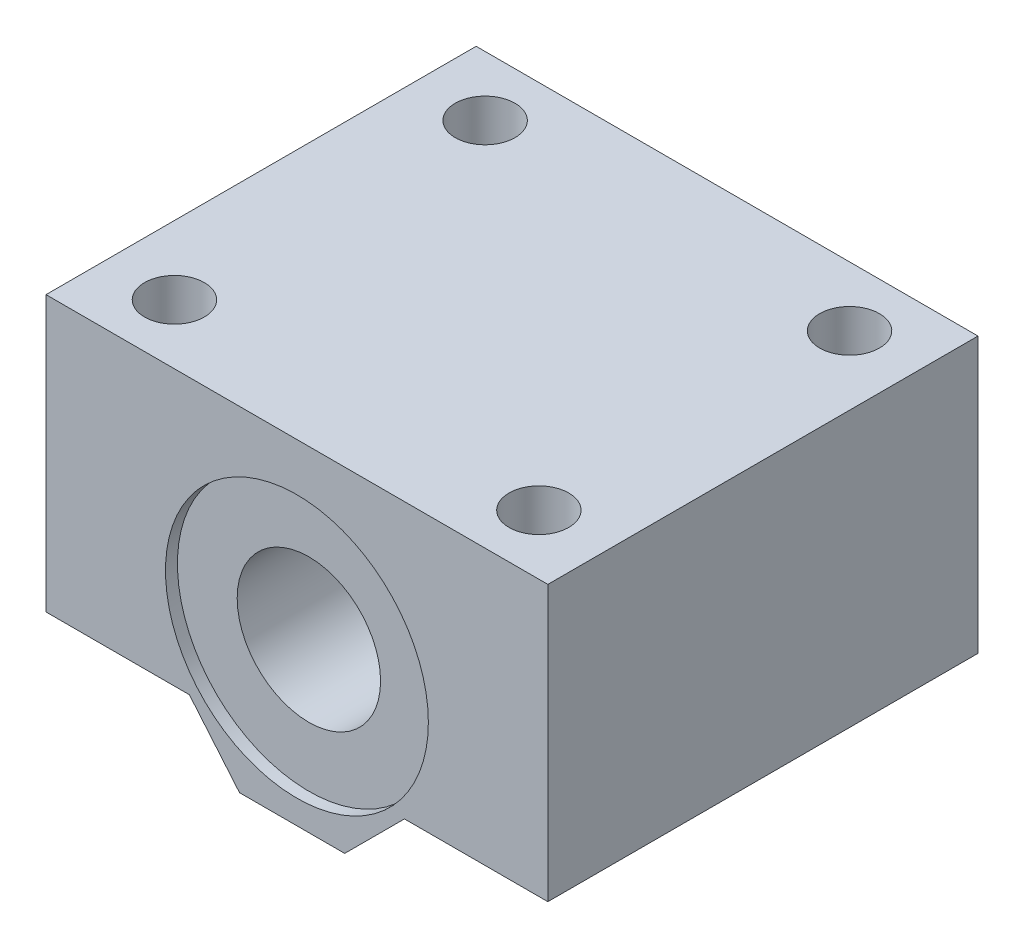
ISO-10303-21;
HEADER;
FILE_DESCRIPTION(('STEP AP214'),'2;1');
FILE_NAME('part.step','',(''),(''),'','','');
FILE_SCHEMA(('AUTOMOTIVE_DESIGN { 1 0 10303 214 1 1 1 1 }'));
ENDSEC;
DATA;
#1=APPLICATION_CONTEXT('core data for automotive mechanical design processes');
#2=APPLICATION_PROTOCOL_DEFINITION('international standard','automotive_design',2000,#1);
#3=PRODUCT_CONTEXT('',#1,'mechanical');
#4=PRODUCT('Part','Part','',(#3));
#5=PRODUCT_RELATED_PRODUCT_CATEGORY('part','',(#4));
#6=PRODUCT_DEFINITION_FORMATION('','',#4);
#7=PRODUCT_DEFINITION_CONTEXT('part definition',#1,'design');
#8=PRODUCT_DEFINITION('design','',#6,#7);
#9=PRODUCT_DEFINITION_SHAPE('','',#8);
#10=(LENGTH_UNIT() NAMED_UNIT(*) SI_UNIT(.MILLI.,.METRE.));
#11=(NAMED_UNIT(*) PLANE_ANGLE_UNIT() SI_UNIT($,.RADIAN.));
#12=(NAMED_UNIT(*) SI_UNIT($,.STERADIAN.) SOLID_ANGLE_UNIT());
#13=UNCERTAINTY_MEASURE_WITH_UNIT(LENGTH_MEASURE(1.E-05),#10,'distance_accuracy_value','');
#14=(GEOMETRIC_REPRESENTATION_CONTEXT(3) GLOBAL_UNCERTAINTY_ASSIGNED_CONTEXT((#13)) GLOBAL_UNIT_ASSIGNED_CONTEXT((#10,
#11,#12)) REPRESENTATION_CONTEXT('',''));
#15=CARTESIAN_POINT('',(0.,0.,0.));
#16=DIRECTION('',(0.,0.,1.));
#17=DIRECTION('',(1.,0.,0.));
#18=AXIS2_PLACEMENT_3D('',#15,#16,#17);
#19=CARTESIAN_POINT('',(0.,-1.,18.));
#20=DIRECTION('',(0.,0.,-1.));
#21=DIRECTION('',(-1.,0.,0.));
#22=AXIS2_PLACEMENT_3D('',#19,#20,#21);
#23=CYLINDRICAL_SURFACE('',#22,6.);
#24=CARTESIAN_POINT('',(0.,-1.,17.));
#25=DIRECTION('',(0.,0.,1.));
#26=DIRECTION('',(1.,0.,0.));
#27=AXIS2_PLACEMENT_3D('',#24,#25,#26);
#28=CIRCLE('',#27,6.);
#29=CARTESIAN_POINT('',(6.00000000000001,-1.,17.));
#30=VERTEX_POINT('',#29);
#31=EDGE_CURVE('E173',#30,#30,#28,.T.);
#32=ORIENTED_EDGE('',*,*,#31,.T.);
#33=EDGE_LOOP('',(#32));
#34=FACE_BOUND('',#33,.T.);
#35=CARTESIAN_POINT('',(0.,-1.,-17.));
#36=DIRECTION('',(0.,0.,-1.));
#37=DIRECTION('',(-1.,0.,0.));
#38=AXIS2_PLACEMENT_3D('',#35,#36,#37);
#39=CIRCLE('',#38,6.);
#40=CARTESIAN_POINT('',(-6.,-1.,-17.));
#41=VERTEX_POINT('',#40);
#42=EDGE_CURVE('E38',#41,#41,#39,.T.);
#43=ORIENTED_EDGE('',*,*,#42,.T.);
#44=EDGE_LOOP('',(#43));
#45=FACE_BOUND('',#44,.T.);
#46=ADVANCED_FACE('F34',(#34,#45),#23,.F.);
#47=CARTESIAN_POINT('',(-21.,14.,18.));
#48=DIRECTION('',(0.,-1.,0.));
#49=DIRECTION('',(0.,0.,-1.));
#50=AXIS2_PLACEMENT_3D('',#47,#48,#49);
#51=PLANE('',#50);
#52=CARTESIAN_POINT('',(15.25,14.,-13.));
#53=DIRECTION('',(0.,-1.,0.));
#54=DIRECTION('',(0.,0.,-1.));
#55=AXIS2_PLACEMENT_3D('',#52,#53,#54);
#56=CIRCLE('',#55,2.5);
#57=CARTESIAN_POINT('',(15.25,14.,-15.5));
#58=VERTEX_POINT('',#57);
#59=EDGE_CURVE('E171',#58,#58,#56,.T.);
#60=ORIENTED_EDGE('',*,*,#59,.T.);
#61=EDGE_LOOP('',(#60));
#62=FACE_BOUND('',#61,.T.);
#63=CARTESIAN_POINT('',(-15.25,14.,13.));
#64=DIRECTION('',(0.,-1.,0.));
#65=DIRECTION('',(0.,0.,-1.));
#66=AXIS2_PLACEMENT_3D('',#63,#64,#65);
#67=CIRCLE('',#66,2.5);
#68=CARTESIAN_POINT('',(-15.25,14.,10.5));
#69=VERTEX_POINT('',#68);
#70=EDGE_CURVE('E162',#69,#69,#67,.T.);
#71=ORIENTED_EDGE('',*,*,#70,.T.);
#72=EDGE_LOOP('',(#71));
#73=FACE_BOUND('',#72,.T.);
#74=DIRECTION('',(-1.,0.,0.));
#75=VECTOR('',#74,1.);
#76=CARTESIAN_POINT('',(-21.,14.,-18.));
#77=LINE('',#76,#75);
#78=CARTESIAN_POINT('',(21.,14.,-18.));
#79=VERTEX_POINT('',#78);
#80=CARTESIAN_POINT('',(-21.,14.,-18.));
#81=VERTEX_POINT('',#80);
#82=EDGE_CURVE('E123',#79,#81,#77,.T.);
#83=ORIENTED_EDGE('',*,*,#82,.T.);
#84=DIRECTION('',(0.,0.,-1.));
#85=VECTOR('',#84,1.);
#86=CARTESIAN_POINT('',(-21.,14.,18.));
#87=LINE('',#86,#85);
#88=CARTESIAN_POINT('',(-21.,14.,18.));
#89=VERTEX_POINT('',#88);
#90=EDGE_CURVE('E43',#89,#81,#87,.T.);
#91=ORIENTED_EDGE('',*,*,#90,.F.);
#92=DIRECTION('',(-1.,0.,0.));
#93=VECTOR('',#92,1.);
#94=CARTESIAN_POINT('',(-21.,14.,18.));
#95=LINE('',#94,#93);
#96=CARTESIAN_POINT('',(21.,14.,18.));
#97=VERTEX_POINT('',#96);
#98=EDGE_CURVE('E225',#97,#89,#95,.T.);
#99=ORIENTED_EDGE('',*,*,#98,.F.);
#100=DIRECTION('',(0.,0.,-1.));
#101=VECTOR('',#100,1.);
#102=CARTESIAN_POINT('',(21.,14.,18.));
#103=LINE('',#102,#101);
#104=EDGE_CURVE('E11',#97,#79,#103,.T.);
#105=ORIENTED_EDGE('',*,*,#104,.T.);
#106=EDGE_LOOP('',(#83,#91,#99,#105));
#107=FACE_BOUND('',#106,.T.);
#108=CARTESIAN_POINT('',(15.25,14.,13.));
#109=DIRECTION('',(0.,-1.,0.));
#110=DIRECTION('',(0.,0.,-1.));
#111=AXIS2_PLACEMENT_3D('',#108,#109,#110);
#112=CIRCLE('',#111,2.5);
#113=CARTESIAN_POINT('',(15.25,14.,10.5));
#114=VERTEX_POINT('',#113);
#115=EDGE_CURVE('E167',#114,#114,#112,.T.);
#116=ORIENTED_EDGE('',*,*,#115,.T.);
#117=EDGE_LOOP('',(#116));
#118=FACE_BOUND('',#117,.T.);
#119=CARTESIAN_POINT('',(-15.25,14.,-13.));
#120=DIRECTION('',(0.,-1.,0.));
#121=DIRECTION('',(0.,0.,-1.));
#122=AXIS2_PLACEMENT_3D('',#119,#120,#121);
#123=CIRCLE('',#122,2.5);
#124=CARTESIAN_POINT('',(-15.25,14.,-15.5));
#125=VERTEX_POINT('',#124);
#126=EDGE_CURVE('E175',#125,#125,#123,.T.);
#127=ORIENTED_EDGE('',*,*,#126,.T.);
#128=EDGE_LOOP('',(#127));
#129=FACE_BOUND('',#128,.T.);
#130=ADVANCED_FACE('F246',(#62,#73,#107,#118,#129),#51,.F.);
#131=CARTESIAN_POINT('',(-21.,-9.00000000000001,-18.));
#132=DIRECTION('',(0.,1.,0.));
#133=DIRECTION('',(0.,0.,1.));
#134=AXIS2_PLACEMENT_3D('',#131,#132,#133);
#135=PLANE('',#134);
#136=CARTESIAN_POINT('',(-15.25,-9.00000000000001,13.));
#137=DIRECTION('',(0.,1.,0.));
#138=DIRECTION('',(0.,0.,1.));
#139=AXIS2_PLACEMENT_3D('',#136,#137,#138);
#140=CIRCLE('',#139,2.15);
#141=CARTESIAN_POINT('',(-15.25,-9.00000000000001,15.15));
#142=VERTEX_POINT('',#141);
#143=EDGE_CURVE('E142',#142,#142,#140,.F.);
#144=ORIENTED_EDGE('',*,*,#143,.F.);
#145=EDGE_LOOP('',(#144));
#146=FACE_BOUND('',#145,.T.);
#147=DIRECTION('',(-1.,0.,0.));
#148=VECTOR('',#147,1.);
#149=CARTESIAN_POINT('',(-21.,-9.00000000000001,18.));
#150=LINE('',#149,#148);
#151=CARTESIAN_POINT('',(-9.,-9.00000000000001,18.));
#152=VERTEX_POINT('',#151);
#153=CARTESIAN_POINT('',(-21.,-9.00000000000001,18.));
#154=VERTEX_POINT('',#153);
#155=EDGE_CURVE('E215',#152,#154,#150,.T.);
#156=ORIENTED_EDGE('',*,*,#155,.T.);
#157=DIRECTION('',(0.,0.,1.));
#158=VECTOR('',#157,1.);
#159=CARTESIAN_POINT('',(-21.,-9.00000000000001,-18.));
#160=LINE('',#159,#158);
#161=CARTESIAN_POINT('',(-21.,-9.00000000000001,-18.));
#162=VERTEX_POINT('',#161);
#163=EDGE_CURVE('E124',#162,#154,#160,.T.);
#164=ORIENTED_EDGE('',*,*,#163,.F.);
#165=DIRECTION('',(-1.,0.,0.));
#166=VECTOR('',#165,1.);
#167=CARTESIAN_POINT('',(-21.,-9.00000000000001,-18.));
#168=LINE('',#167,#166);
#169=CARTESIAN_POINT('',(-9.,-9.00000000000001,-18.));
#170=VERTEX_POINT('',#169);
#171=EDGE_CURVE('E214',#170,#162,#168,.T.);
#172=ORIENTED_EDGE('',*,*,#171,.F.);
#173=DIRECTION('',(0.,0.,1.));
#174=VECTOR('',#173,1.);
#175=CARTESIAN_POINT('',(-9.,-9.00000000000001,-18.));
#176=LINE('',#175,#174);
#177=EDGE_CURVE('E129',#170,#152,#176,.T.);
#178=ORIENTED_EDGE('',*,*,#177,.T.);
#179=EDGE_LOOP('',(#156,#164,#172,#178));
#180=FACE_BOUND('',#179,.T.);
#181=CARTESIAN_POINT('',(-15.25,-9.00000000000001,-13.));
#182=DIRECTION('',(0.,1.,0.));
#183=DIRECTION('',(0.,0.,1.));
#184=AXIS2_PLACEMENT_3D('',#181,#182,#183);
#185=CIRCLE('',#184,2.15);
#186=CARTESIAN_POINT('',(-15.25,-9.00000000000001,-10.85));
#187=VERTEX_POINT('',#186);
#188=EDGE_CURVE('E152',#187,#187,#185,.F.);
#189=ORIENTED_EDGE('',*,*,#188,.F.);
#190=EDGE_LOOP('',(#189));
#191=FACE_BOUND('',#190,.T.);
#192=ADVANCED_FACE('F249',(#146,#180,#191),#135,.F.);
#193=CARTESIAN_POINT('',(21.,-9.00000000000001,-18.));
#194=DIRECTION('',(0.,1.,0.));
#195=DIRECTION('',(-1.,0.,0.));
#196=AXIS2_PLACEMENT_3D('',#193,#194,#195);
#197=PLANE('',#196);
#198=CARTESIAN_POINT('',(15.25,-9.00000000000001,13.));
#199=DIRECTION('',(0.,1.,0.));
#200=DIRECTION('',(-1.,0.,0.));
#201=AXIS2_PLACEMENT_3D('',#198,#199,#200);
#202=CIRCLE('',#201,2.15);
#203=CARTESIAN_POINT('',(13.1,-9.00000000000001,13.));
#204=VERTEX_POINT('',#203);
#205=EDGE_CURVE('E146',#204,#204,#202,.F.);
#206=ORIENTED_EDGE('',*,*,#205,.F.);
#207=EDGE_LOOP('',(#206));
#208=FACE_BOUND('',#207,.T.);
#209=DIRECTION('',(-1.,0.,0.));
#210=VECTOR('',#209,1.);
#211=CARTESIAN_POINT('',(21.,-9.00000000000001,18.));
#212=LINE('',#211,#210);
#213=CARTESIAN_POINT('',(21.,-9.00000000000001,18.));
#214=VERTEX_POINT('',#213);
#215=CARTESIAN_POINT('',(9.00000000000001,-9.00000000000001,18.));
#216=VERTEX_POINT('',#215);
#217=EDGE_CURVE('E145',#214,#216,#212,.T.);
#218=ORIENTED_EDGE('',*,*,#217,.T.);
#219=DIRECTION('',(0.,0.,1.));
#220=VECTOR('',#219,1.);
#221=CARTESIAN_POINT('',(9.00000000000001,-9.00000000000001,-18.));
#222=LINE('',#221,#220);
#223=CARTESIAN_POINT('',(9.00000000000001,-9.00000000000001,-18.));
#224=VERTEX_POINT('',#223);
#225=EDGE_CURVE('E107',#224,#216,#222,.T.);
#226=ORIENTED_EDGE('',*,*,#225,.F.);
#227=DIRECTION('',(-1.,0.,0.));
#228=VECTOR('',#227,1.);
#229=CARTESIAN_POINT('',(21.,-9.00000000000001,-18.));
#230=LINE('',#229,#228);
#231=CARTESIAN_POINT('',(21.,-9.00000000000001,-18.));
#232=VERTEX_POINT('',#231);
#233=EDGE_CURVE('E100',#232,#224,#230,.T.);
#234=ORIENTED_EDGE('',*,*,#233,.F.);
#235=DIRECTION('',(0.,0.,1.));
#236=VECTOR('',#235,1.);
#237=CARTESIAN_POINT('',(21.,-9.00000000000001,-18.));
#238=LINE('',#237,#236);
#239=EDGE_CURVE('E105',#232,#214,#238,.T.);
#240=ORIENTED_EDGE('',*,*,#239,.T.);
#241=EDGE_LOOP('',(#218,#226,#234,#240));
#242=FACE_BOUND('',#241,.T.);
#243=CARTESIAN_POINT('',(15.25,-9.00000000000001,-13.));
#244=DIRECTION('',(0.,1.,0.));
#245=DIRECTION('',(-1.,0.,0.));
#246=AXIS2_PLACEMENT_3D('',#243,#244,#245);
#247=CIRCLE('',#246,2.15);
#248=CARTESIAN_POINT('',(13.1,-9.00000000000001,-13.));
#249=VERTEX_POINT('',#248);
#250=EDGE_CURVE('E149',#249,#249,#247,.F.);
#251=ORIENTED_EDGE('',*,*,#250,.F.);
#252=EDGE_LOOP('',(#251));
#253=FACE_BOUND('',#252,.T.);
#254=ADVANCED_FACE('F103',(#208,#242,#253),#197,.F.);
#255=CARTESIAN_POINT('',(0.,0.,18.));
#256=DIRECTION('',(0.,0.,-1.));
#257=DIRECTION('',(-1.,0.,0.));
#258=AXIS2_PLACEMENT_3D('',#255,#256,#257);
#259=PLANE('',#258);
#260=CARTESIAN_POINT('',(0.,-1.,18.));
#261=DIRECTION('',(0.,0.,1.));
#262=DIRECTION('',(1.,0.,0.));
#263=AXIS2_PLACEMENT_3D('',#260,#261,#262);
#264=CIRCLE('',#263,11.);
#265=CARTESIAN_POINT('',(11.,-1.,18.));
#266=VERTEX_POINT('',#265);
#267=EDGE_CURVE('E182',#266,#266,#264,.T.);
#268=ORIENTED_EDGE('',*,*,#267,.F.);
#269=EDGE_LOOP('',(#268));
#270=FACE_BOUND('',#269,.T.);
#271=DIRECTION('',(1.,0.,0.));
#272=VECTOR('',#271,1.);
#273=CARTESIAN_POINT('',(-21.,-14.,18.));
#274=LINE('',#273,#272);
#275=CARTESIAN_POINT('',(-4.80450184411362,-14.,18.));
#276=VERTEX_POINT('',#275);
#277=CARTESIAN_POINT('',(4.00000000000002,-14.,18.));
#278=VERTEX_POINT('',#277);
#279=EDGE_CURVE('E132',#276,#278,#274,.T.);
#280=ORIENTED_EDGE('',*,*,#279,.T.);
#281=DIRECTION('',(-0.707106781186546,-0.707106781186549,0.));
#282=VECTOR('',#281,1.);
#283=CARTESIAN_POINT('',(9.00000000000001,-9.00000000000001,18.));
#284=LINE('',#283,#282);
#285=EDGE_CURVE('E51',#216,#278,#284,.T.);
#286=ORIENTED_EDGE('',*,*,#285,.F.);
#287=ORIENTED_EDGE('',*,*,#217,.F.);
#288=DIRECTION('',(0.,1.,0.));
#289=VECTOR('',#288,1.);
#290=CARTESIAN_POINT('',(21.,-14.,18.));
#291=LINE('',#290,#289);
#292=EDGE_CURVE('E119',#214,#97,#291,.T.);
#293=ORIENTED_EDGE('',*,*,#292,.T.);
#294=ORIENTED_EDGE('',*,*,#98,.T.);
#295=DIRECTION('',(0.,-1.,0.));
#296=VECTOR('',#295,1.);
#297=CARTESIAN_POINT('',(-21.,-14.,18.));
#298=LINE('',#297,#296);
#299=EDGE_CURVE('E226',#89,#154,#298,.T.);
#300=ORIENTED_EDGE('',*,*,#299,.T.);
#301=ORIENTED_EDGE('',*,*,#155,.F.);
#302=DIRECTION('',(-0.642787609686538,0.766044443118979,0.));
#303=VECTOR('',#302,1.);
#304=CARTESIAN_POINT('',(-9.,-9.00000000000001,18.));
#305=LINE('',#304,#303);
#306=EDGE_CURVE('E211',#276,#152,#305,.T.);
#307=ORIENTED_EDGE('',*,*,#306,.F.);
#308=EDGE_LOOP('',(#280,#286,#287,#293,#294,#300,#301,#307));
#309=FACE_BOUND('',#308,.T.);
#310=ADVANCED_FACE('F234',(#270,#309),#259,.F.);
#311=CARTESIAN_POINT('',(0.,0.,-18.));
#312=DIRECTION('',(0.,0.,-1.));
#313=DIRECTION('',(-1.,0.,0.));
#314=AXIS2_PLACEMENT_3D('',#311,#312,#313);
#315=PLANE('',#314);
#316=CARTESIAN_POINT('',(0.,-1.,-18.));
#317=DIRECTION('',(0.,0.,-1.));
#318=DIRECTION('',(-1.,0.,0.));
#319=AXIS2_PLACEMENT_3D('',#316,#317,#318);
#320=CIRCLE('',#319,11.);
#321=CARTESIAN_POINT('',(-11.,-1.,-18.));
#322=VERTEX_POINT('',#321);
#323=EDGE_CURVE('E189',#322,#322,#320,.T.);
#324=ORIENTED_EDGE('',*,*,#323,.F.);
#325=EDGE_LOOP('',(#324));
#326=FACE_BOUND('',#325,.T.);
#327=DIRECTION('',(-0.707106781186546,-0.707106781186549,0.));
#328=VECTOR('',#327,1.);
#329=CARTESIAN_POINT('',(9.00000000000001,-9.00000000000001,-18.));
#330=LINE('',#329,#328);
#331=CARTESIAN_POINT('',(4.00000000000003,-14.,-18.));
#332=VERTEX_POINT('',#331);
#333=EDGE_CURVE('E112',#224,#332,#330,.T.);
#334=ORIENTED_EDGE('',*,*,#333,.T.);
#335=DIRECTION('',(1.,0.,0.));
#336=VECTOR('',#335,1.);
#337=CARTESIAN_POINT('',(-21.,-14.,-18.));
#338=LINE('',#337,#336);
#339=CARTESIAN_POINT('',(-4.80450184411363,-14.,-18.));
#340=VERTEX_POINT('',#339);
#341=EDGE_CURVE('E137',#340,#332,#338,.T.);
#342=ORIENTED_EDGE('',*,*,#341,.F.);
#343=DIRECTION('',(-0.642787609686538,0.766044443118979,0.));
#344=VECTOR('',#343,1.);
#345=CARTESIAN_POINT('',(-9.,-9.00000000000001,-18.));
#346=LINE('',#345,#344);
#347=EDGE_CURVE('E59',#340,#170,#346,.T.);
#348=ORIENTED_EDGE('',*,*,#347,.T.);
#349=ORIENTED_EDGE('',*,*,#171,.T.);
#350=DIRECTION('',(0.,-1.,0.));
#351=VECTOR('',#350,1.);
#352=CARTESIAN_POINT('',(-21.,-14.,-18.));
#353=LINE('',#352,#351);
#354=EDGE_CURVE('E126',#81,#162,#353,.T.);
#355=ORIENTED_EDGE('',*,*,#354,.F.);
#356=ORIENTED_EDGE('',*,*,#82,.F.);
#357=DIRECTION('',(0.,1.,0.));
#358=VECTOR('',#357,1.);
#359=CARTESIAN_POINT('',(21.,-14.,-18.));
#360=LINE('',#359,#358);
#361=EDGE_CURVE('E117',#232,#79,#360,.T.);
#362=ORIENTED_EDGE('',*,*,#361,.F.);
#363=ORIENTED_EDGE('',*,*,#233,.T.);
#364=EDGE_LOOP('',(#334,#342,#348,#349,#355,#356,#362,#363));
#365=FACE_BOUND('',#364,.T.);
#366=ADVANCED_FACE('F121',(#326,#365),#315,.T.);
#367=CARTESIAN_POINT('',(21.,-14.,18.));
#368=DIRECTION('',(-1.,0.,0.));
#369=DIRECTION('',(0.,0.,1.));
#370=AXIS2_PLACEMENT_3D('',#367,#368,#369);
#371=PLANE('',#370);
#372=ORIENTED_EDGE('',*,*,#292,.F.);
#373=ORIENTED_EDGE('',*,*,#239,.F.);
#374=ORIENTED_EDGE('',*,*,#361,.T.);
#375=ORIENTED_EDGE('',*,*,#104,.F.);
#376=EDGE_LOOP('',(#372,#373,#374,#375));
#377=FACE_BOUND('',#376,.T.);
#378=ADVANCED_FACE('F36',(#377),#371,.F.);
#379=CARTESIAN_POINT('',(-21.,-14.,18.));
#380=DIRECTION('',(1.,0.,0.));
#381=DIRECTION('',(0.,0.,-1.));
#382=AXIS2_PLACEMENT_3D('',#379,#380,#381);
#383=PLANE('',#382);
#384=ORIENTED_EDGE('',*,*,#354,.T.);
#385=ORIENTED_EDGE('',*,*,#163,.T.);
#386=ORIENTED_EDGE('',*,*,#299,.F.);
#387=ORIENTED_EDGE('',*,*,#90,.T.);
#388=EDGE_LOOP('',(#384,#385,#386,#387));
#389=FACE_BOUND('',#388,.T.);
#390=ADVANCED_FACE('F242',(#389),#383,.F.);
#391=CARTESIAN_POINT('',(-21.,-14.,18.));
#392=DIRECTION('',(0.,1.,0.));
#393=DIRECTION('',(0.,0.,1.));
#394=AXIS2_PLACEMENT_3D('',#391,#392,#393);
#395=PLANE('',#394);
#396=ORIENTED_EDGE('',*,*,#341,.T.);
#397=DIRECTION('',(0.,0.,1.));
#398=VECTOR('',#397,1.);
#399=CARTESIAN_POINT('',(4.00000000000003,-14.,-18.));
#400=LINE('',#399,#398);
#401=EDGE_CURVE('E209',#332,#278,#400,.T.);
#402=ORIENTED_EDGE('',*,*,#401,.T.);
#403=ORIENTED_EDGE('',*,*,#279,.F.);
#404=DIRECTION('',(0.,0.,1.));
#405=VECTOR('',#404,1.);
#406=CARTESIAN_POINT('',(-4.80450184411362,-14.,-18.));
#407=LINE('',#406,#405);
#408=EDGE_CURVE('E218',#340,#276,#407,.T.);
#409=ORIENTED_EDGE('',*,*,#408,.F.);
#410=EDGE_LOOP('',(#396,#402,#403,#409));
#411=FACE_BOUND('',#410,.T.);
#412=ADVANCED_FACE('F236',(#411),#395,.F.);
#413=CARTESIAN_POINT('',(-9.,-9.00000000000001,-18.));
#414=DIRECTION('',(0.766044443118979,0.642787609686538,0.));
#415=DIRECTION('',(-0.642787609686538,0.766044443118979,0.));
#416=AXIS2_PLACEMENT_3D('',#413,#414,#415);
#417=PLANE('',#416);
#418=ORIENTED_EDGE('',*,*,#306,.T.);
#419=ORIENTED_EDGE('',*,*,#177,.F.);
#420=ORIENTED_EDGE('',*,*,#347,.F.);
#421=ORIENTED_EDGE('',*,*,#408,.T.);
#422=EDGE_LOOP('',(#418,#419,#420,#421));
#423=FACE_BOUND('',#422,.T.);
#424=ADVANCED_FACE('F278',(#423),#417,.F.);
#425=CARTESIAN_POINT('',(9.00000000000001,-9.00000000000001,-18.));
#426=DIRECTION('',(-0.707106781186549,0.707106781186546,0.));
#427=DIRECTION('',(-0.707106781186546,-0.707106781186549,0.));
#428=AXIS2_PLACEMENT_3D('',#425,#426,#427);
#429=PLANE('',#428);
#430=ORIENTED_EDGE('',*,*,#285,.T.);
#431=ORIENTED_EDGE('',*,*,#401,.F.);
#432=ORIENTED_EDGE('',*,*,#333,.F.);
#433=ORIENTED_EDGE('',*,*,#225,.T.);
#434=EDGE_LOOP('',(#430,#431,#432,#433));
#435=FACE_BOUND('',#434,.T.);
#436=ADVANCED_FACE('F238',(#435),#429,.F.);
#437=CARTESIAN_POINT('',(-15.25,-14.,13.));
#438=DIRECTION('',(0.,1.,0.));
#439=DIRECTION('',(0.,0.,1.));
#440=AXIS2_PLACEMENT_3D('',#437,#438,#439);
#441=CYLINDRICAL_SURFACE('',#440,2.15);
#442=CARTESIAN_POINT('',(-15.25,2.,13.));
#443=DIRECTION('',(0.,-1.,0.));
#444=DIRECTION('',(0.,0.,-1.));
#445=AXIS2_PLACEMENT_3D('',#442,#443,#444);
#446=CIRCLE('',#445,2.15);
#447=CARTESIAN_POINT('',(-15.25,2.,10.85));
#448=VERTEX_POINT('',#447);
#449=EDGE_CURVE('E155',#448,#448,#446,.T.);
#450=ORIENTED_EDGE('',*,*,#449,.F.);
#451=EDGE_LOOP('',(#450));
#452=FACE_BOUND('',#451,.T.);
#453=ORIENTED_EDGE('',*,*,#143,.T.);
#454=EDGE_LOOP('',(#453));
#455=FACE_BOUND('',#454,.T.);
#456=ADVANCED_FACE('F330',(#452,#455),#441,.F.);
#457=CARTESIAN_POINT('',(15.25,-14.,13.));
#458=DIRECTION('',(0.,1.,0.));
#459=DIRECTION('',(0.,0.,1.));
#460=AXIS2_PLACEMENT_3D('',#457,#458,#459);
#461=CYLINDRICAL_SURFACE('',#460,2.15);
#462=CARTESIAN_POINT('',(15.25,2.,13.));
#463=DIRECTION('',(0.,-1.,0.));
#464=DIRECTION('',(0.,0.,-1.));
#465=AXIS2_PLACEMENT_3D('',#462,#463,#464);
#466=CIRCLE('',#465,2.15);
#467=CARTESIAN_POINT('',(15.25,2.,10.85));
#468=VERTEX_POINT('',#467);
#469=EDGE_CURVE('E159',#468,#468,#466,.T.);
#470=ORIENTED_EDGE('',*,*,#469,.F.);
#471=EDGE_LOOP('',(#470));
#472=FACE_BOUND('',#471,.T.);
#473=ORIENTED_EDGE('',*,*,#205,.T.);
#474=EDGE_LOOP('',(#473));
#475=FACE_BOUND('',#474,.T.);
#476=ADVANCED_FACE('F335',(#472,#475),#461,.F.);
#477=CARTESIAN_POINT('',(15.25,-14.,-13.));
#478=DIRECTION('',(0.,1.,0.));
#479=DIRECTION('',(0.,0.,1.));
#480=AXIS2_PLACEMENT_3D('',#477,#478,#479);
#481=CYLINDRICAL_SURFACE('',#480,2.15);
#482=CARTESIAN_POINT('',(15.25,2.,-13.));
#483=DIRECTION('',(0.,-1.,0.));
#484=DIRECTION('',(0.,0.,-1.));
#485=AXIS2_PLACEMENT_3D('',#482,#483,#484);
#486=CIRCLE('',#485,2.15);
#487=CARTESIAN_POINT('',(15.25,2.,-15.15));
#488=VERTEX_POINT('',#487);
#489=EDGE_CURVE('E164',#488,#488,#486,.T.);
#490=ORIENTED_EDGE('',*,*,#489,.F.);
#491=EDGE_LOOP('',(#490));
#492=FACE_BOUND('',#491,.T.);
#493=ORIENTED_EDGE('',*,*,#250,.T.);
#494=EDGE_LOOP('',(#493));
#495=FACE_BOUND('',#494,.T.);
#496=ADVANCED_FACE('F346',(#492,#495),#481,.F.);
#497=CARTESIAN_POINT('',(-15.25,-14.,-13.));
#498=DIRECTION('',(0.,1.,0.));
#499=DIRECTION('',(0.,0.,1.));
#500=AXIS2_PLACEMENT_3D('',#497,#498,#499);
#501=CYLINDRICAL_SURFACE('',#500,2.15);
#502=CARTESIAN_POINT('',(-15.25,2.,-13.));
#503=DIRECTION('',(0.,-1.,0.));
#504=DIRECTION('',(0.,0.,-1.));
#505=AXIS2_PLACEMENT_3D('',#502,#503,#504);
#506=CIRCLE('',#505,2.15);
#507=CARTESIAN_POINT('',(-15.25,2.,-15.15));
#508=VERTEX_POINT('',#507);
#509=EDGE_CURVE('E169',#508,#508,#506,.T.);
#510=ORIENTED_EDGE('',*,*,#509,.F.);
#511=EDGE_LOOP('',(#510));
#512=FACE_BOUND('',#511,.T.);
#513=ORIENTED_EDGE('',*,*,#188,.T.);
#514=EDGE_LOOP('',(#513));
#515=FACE_BOUND('',#514,.T.);
#516=ADVANCED_FACE('F356',(#512,#515),#501,.F.);
#517=CARTESIAN_POINT('',(-15.25,2.,13.));
#518=DIRECTION('',(0.,1.,0.));
#519=DIRECTION('',(0.,0.,1.));
#520=AXIS2_PLACEMENT_3D('',#517,#518,#519);
#521=CYLINDRICAL_SURFACE('',#520,2.5);
#522=CARTESIAN_POINT('',(-15.25,2.,13.));
#523=DIRECTION('',(0.,-1.,0.));
#524=DIRECTION('',(0.,0.,-1.));
#525=AXIS2_PLACEMENT_3D('',#522,#523,#524);
#526=CIRCLE('',#525,2.5);
#527=CARTESIAN_POINT('',(-15.25,2.,10.5));
#528=VERTEX_POINT('',#527);
#529=EDGE_CURVE('E158',#528,#528,#526,.T.);
#530=ORIENTED_EDGE('',*,*,#529,.T.);
#531=EDGE_LOOP('',(#530));
#532=FACE_BOUND('',#531,.T.);
#533=ORIENTED_EDGE('',*,*,#70,.F.);
#534=EDGE_LOOP('',(#533));
#535=FACE_BOUND('',#534,.T.);
#536=ADVANCED_FACE('F365',(#532,#535),#521,.F.);
#537=CARTESIAN_POINT('',(-15.25,2.,13.));
#538=DIRECTION('',(0.,-1.,0.));
#539=DIRECTION('',(0.,0.,-1.));
#540=AXIS2_PLACEMENT_3D('',#537,#538,#539);
#541=PLANE('',#540);
#542=ORIENTED_EDGE('',*,*,#449,.T.);
#543=EDGE_LOOP('',(#542));
#544=FACE_BOUND('',#543,.T.);
#545=ORIENTED_EDGE('',*,*,#529,.F.);
#546=EDGE_LOOP('',(#545));
#547=FACE_BOUND('',#546,.T.);
#548=ADVANCED_FACE('F374',(#544,#547),#541,.F.);
#549=CARTESIAN_POINT('',(15.25,2.,13.));
#550=DIRECTION('',(0.,1.,0.));
#551=DIRECTION('',(0.,0.,1.));
#552=AXIS2_PLACEMENT_3D('',#549,#550,#551);
#553=CYLINDRICAL_SURFACE('',#552,2.5);
#554=CARTESIAN_POINT('',(15.25,2.,13.));
#555=DIRECTION('',(0.,-1.,0.));
#556=DIRECTION('',(0.,0.,-1.));
#557=AXIS2_PLACEMENT_3D('',#554,#555,#556);
#558=CIRCLE('',#557,2.5);
#559=CARTESIAN_POINT('',(15.25,2.,10.5));
#560=VERTEX_POINT('',#559);
#561=EDGE_CURVE('E163',#560,#560,#558,.T.);
#562=ORIENTED_EDGE('',*,*,#561,.T.);
#563=EDGE_LOOP('',(#562));
#564=FACE_BOUND('',#563,.T.);
#565=ORIENTED_EDGE('',*,*,#115,.F.);
#566=EDGE_LOOP('',(#565));
#567=FACE_BOUND('',#566,.T.);
#568=ADVANCED_FACE('F384',(#564,#567),#553,.F.);
#569=CARTESIAN_POINT('',(15.25,2.,13.));
#570=DIRECTION('',(0.,-1.,0.));
#571=DIRECTION('',(0.,0.,-1.));
#572=AXIS2_PLACEMENT_3D('',#569,#570,#571);
#573=PLANE('',#572);
#574=ORIENTED_EDGE('',*,*,#469,.T.);
#575=EDGE_LOOP('',(#574));
#576=FACE_BOUND('',#575,.T.);
#577=ORIENTED_EDGE('',*,*,#561,.F.);
#578=EDGE_LOOP('',(#577));
#579=FACE_BOUND('',#578,.T.);
#580=ADVANCED_FACE('F394',(#576,#579),#573,.F.);
#581=CARTESIAN_POINT('',(15.25,2.,-13.));
#582=DIRECTION('',(0.,1.,0.));
#583=DIRECTION('',(0.,0.,1.));
#584=AXIS2_PLACEMENT_3D('',#581,#582,#583);
#585=CYLINDRICAL_SURFACE('',#584,2.5);
#586=CARTESIAN_POINT('',(15.25,2.,-13.));
#587=DIRECTION('',(0.,-1.,0.));
#588=DIRECTION('',(0.,0.,-1.));
#589=AXIS2_PLACEMENT_3D('',#586,#587,#588);
#590=CIRCLE('',#589,2.5);
#591=CARTESIAN_POINT('',(15.25,2.,-15.5));
#592=VERTEX_POINT('',#591);
#593=EDGE_CURVE('E168',#592,#592,#590,.T.);
#594=ORIENTED_EDGE('',*,*,#593,.T.);
#595=EDGE_LOOP('',(#594));
#596=FACE_BOUND('',#595,.T.);
#597=ORIENTED_EDGE('',*,*,#59,.F.);
#598=EDGE_LOOP('',(#597));
#599=FACE_BOUND('',#598,.T.);
#600=ADVANCED_FACE('F268',(#596,#599),#585,.F.);
#601=CARTESIAN_POINT('',(15.25,2.,-13.));
#602=DIRECTION('',(0.,-1.,0.));
#603=DIRECTION('',(0.,0.,-1.));
#604=AXIS2_PLACEMENT_3D('',#601,#602,#603);
#605=PLANE('',#604);
#606=ORIENTED_EDGE('',*,*,#489,.T.);
#607=EDGE_LOOP('',(#606));
#608=FACE_BOUND('',#607,.T.);
#609=ORIENTED_EDGE('',*,*,#593,.F.);
#610=EDGE_LOOP('',(#609));
#611=FACE_BOUND('',#610,.T.);
#612=ADVANCED_FACE('F258',(#608,#611),#605,.F.);
#613=CARTESIAN_POINT('',(-15.25,2.,-13.));
#614=DIRECTION('',(0.,1.,0.));
#615=DIRECTION('',(0.,0.,1.));
#616=AXIS2_PLACEMENT_3D('',#613,#614,#615);
#617=CYLINDRICAL_SURFACE('',#616,2.5);
#618=CARTESIAN_POINT('',(-15.25,2.,-13.));
#619=DIRECTION('',(0.,-1.,0.));
#620=DIRECTION('',(0.,0.,-1.));
#621=AXIS2_PLACEMENT_3D('',#618,#619,#620);
#622=CIRCLE('',#621,2.5);
#623=CARTESIAN_POINT('',(-15.25,2.,-15.5));
#624=VERTEX_POINT('',#623);
#625=EDGE_CURVE('E172',#624,#624,#622,.T.);
#626=ORIENTED_EDGE('',*,*,#625,.T.);
#627=EDGE_LOOP('',(#626));
#628=FACE_BOUND('',#627,.T.);
#629=ORIENTED_EDGE('',*,*,#126,.F.);
#630=EDGE_LOOP('',(#629));
#631=FACE_BOUND('',#630,.T.);
#632=ADVANCED_FACE('F255',(#628,#631),#617,.F.);
#633=CARTESIAN_POINT('',(-15.25,2.,-13.));
#634=DIRECTION('',(0.,-1.,0.));
#635=DIRECTION('',(0.,0.,-1.));
#636=AXIS2_PLACEMENT_3D('',#633,#634,#635);
#637=PLANE('',#636);
#638=ORIENTED_EDGE('',*,*,#509,.T.);
#639=EDGE_LOOP('',(#638));
#640=FACE_BOUND('',#639,.T.);
#641=ORIENTED_EDGE('',*,*,#625,.F.);
#642=EDGE_LOOP('',(#641));
#643=FACE_BOUND('',#642,.T.);
#644=ADVANCED_FACE('F257',(#640,#643),#637,.F.);
#645=CARTESIAN_POINT('',(0.,-1.,17.));
#646=DIRECTION('',(0.,0.,1.));
#647=DIRECTION('',(1.,0.,0.));
#648=AXIS2_PLACEMENT_3D('',#645,#646,#647);
#649=CYLINDRICAL_SURFACE('',#648,11.);
#650=CARTESIAN_POINT('',(0.,-1.,17.));
#651=DIRECTION('',(0.,0.,1.));
#652=DIRECTION('',(1.,0.,0.));
#653=AXIS2_PLACEMENT_3D('',#650,#651,#652);
#654=CIRCLE('',#653,11.);
#655=CARTESIAN_POINT('',(11.,-1.,17.));
#656=VERTEX_POINT('',#655);
#657=EDGE_CURVE('E176',#656,#656,#654,.T.);
#658=ORIENTED_EDGE('',*,*,#657,.F.);
#659=EDGE_LOOP('',(#658));
#660=FACE_BOUND('',#659,.T.);
#661=ORIENTED_EDGE('',*,*,#267,.T.);
#662=EDGE_LOOP('',(#661));
#663=FACE_BOUND('',#662,.T.);
#664=ADVANCED_FACE('F265',(#660,#663),#649,.F.);
#665=CARTESIAN_POINT('',(0.,-1.,17.));
#666=DIRECTION('',(0.,0.,1.));
#667=DIRECTION('',(1.,0.,0.));
#668=AXIS2_PLACEMENT_3D('',#665,#666,#667);
#669=PLANE('',#668);
#670=ORIENTED_EDGE('',*,*,#31,.F.);
#671=EDGE_LOOP('',(#670));
#672=FACE_BOUND('',#671,.T.);
#673=ORIENTED_EDGE('',*,*,#657,.T.);
#674=EDGE_LOOP('',(#673));
#675=FACE_BOUND('',#674,.T.);
#676=ADVANCED_FACE('F436',(#672,#675),#669,.T.);
#677=CARTESIAN_POINT('',(0.,-1.,-17.));
#678=DIRECTION('',(0.,0.,-1.));
#679=DIRECTION('',(-1.,0.,0.));
#680=AXIS2_PLACEMENT_3D('',#677,#678,#679);
#681=CYLINDRICAL_SURFACE('',#680,11.);
#682=CARTESIAN_POINT('',(0.,-1.,-17.));
#683=DIRECTION('',(0.,0.,-1.));
#684=DIRECTION('',(-1.,0.,0.));
#685=AXIS2_PLACEMENT_3D('',#682,#683,#684);
#686=CIRCLE('',#685,11.);
#687=CARTESIAN_POINT('',(-11.,-1.,-17.));
#688=VERTEX_POINT('',#687);
#689=EDGE_CURVE('E482',#688,#688,#686,.T.);
#690=ORIENTED_EDGE('',*,*,#689,.F.);
#691=EDGE_LOOP('',(#690));
#692=FACE_BOUND('',#691,.T.);
#693=ORIENTED_EDGE('',*,*,#323,.T.);
#694=EDGE_LOOP('',(#693));
#695=FACE_BOUND('',#694,.T.);
#696=ADVANCED_FACE('F444',(#692,#695),#681,.F.);
#697=CARTESIAN_POINT('',(0.,-1.,-17.));
#698=DIRECTION('',(0.,0.,-1.));
#699=DIRECTION('',(-1.,0.,0.));
#700=AXIS2_PLACEMENT_3D('',#697,#698,#699);
#701=PLANE('',#700);
#702=ORIENTED_EDGE('',*,*,#42,.F.);
#703=EDGE_LOOP('',(#702));
#704=FACE_BOUND('',#703,.T.);
#705=ORIENTED_EDGE('',*,*,#689,.T.);
#706=EDGE_LOOP('',(#705));
#707=FACE_BOUND('',#706,.T.);
#708=ADVANCED_FACE('F451',(#704,#707),#701,.T.);
#709=CLOSED_SHELL('',(#46,#130,#192,#254,#310,#366,#378,#390,#412,#424,#436,#456,#476,#496,#516,
#536,#548,#568,#580,#600,#612,#632,#644,#664,#676,#696,#708));
#710=MANIFOLD_SOLID_BREP('B2',#709);
#711=ADVANCED_BREP_SHAPE_REPRESENTATION('',(#18,#710),#14);
#712=SHAPE_DEFINITION_REPRESENTATION(#9,#711);
ENDSEC;
END-ISO-10303-21;
